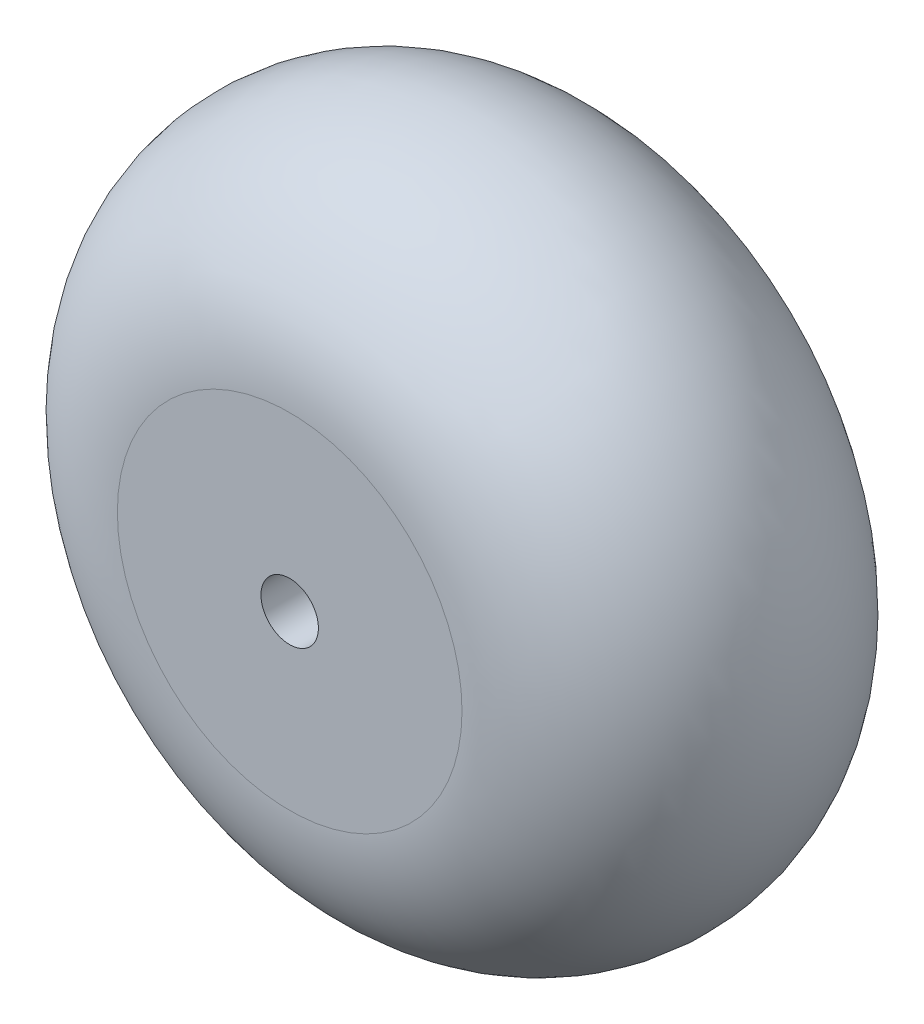
ISO-10303-21;
HEADER;
FILE_DESCRIPTION(('STEP AP214'),'2;1');
FILE_NAME('part.step','',(''),(''),'','','');
FILE_SCHEMA(('AUTOMOTIVE_DESIGN { 1 0 10303 214 1 1 1 1 }'));
ENDSEC;
DATA;
#1=APPLICATION_CONTEXT('core data for automotive mechanical design processes');
#2=APPLICATION_PROTOCOL_DEFINITION('international standard','automotive_design',2000,#1);
#3=PRODUCT_CONTEXT('',#1,'mechanical');
#4=PRODUCT('Part','Part','',(#3));
#5=PRODUCT_RELATED_PRODUCT_CATEGORY('part','',(#4));
#6=PRODUCT_DEFINITION_FORMATION('','',#4);
#7=PRODUCT_DEFINITION_CONTEXT('part definition',#1,'design');
#8=PRODUCT_DEFINITION('design','',#6,#7);
#9=PRODUCT_DEFINITION_SHAPE('','',#8);
#10=(LENGTH_UNIT() NAMED_UNIT(*) SI_UNIT(.MILLI.,.METRE.));
#11=(NAMED_UNIT(*) PLANE_ANGLE_UNIT() SI_UNIT($,.RADIAN.));
#12=(NAMED_UNIT(*) SI_UNIT($,.STERADIAN.) SOLID_ANGLE_UNIT());
#13=UNCERTAINTY_MEASURE_WITH_UNIT(LENGTH_MEASURE(1.E-05),#10,'distance_accuracy_value','');
#14=(GEOMETRIC_REPRESENTATION_CONTEXT(3) GLOBAL_UNCERTAINTY_ASSIGNED_CONTEXT((#13)) GLOBAL_UNIT_ASSIGNED_CONTEXT((#10,
#11,#12)) REPRESENTATION_CONTEXT('',''));
#15=CARTESIAN_POINT('',(0.,0.,0.));
#16=DIRECTION('',(0.,0.,1.));
#17=DIRECTION('',(1.,0.,0.));
#18=AXIS2_PLACEMENT_3D('',#15,#16,#17);
#19=CARTESIAN_POINT('',(0.,0.,15.));
#20=DIRECTION('',(0.,0.,1.));
#21=DIRECTION('',(1.,0.,0.));
#22=AXIS2_PLACEMENT_3D('',#19,#20,#21);
#23=DEGENERATE_TOROIDAL_SURFACE('',#22,15.,15.,.T.);
#24=CARTESIAN_POINT('',(0.,0.,0.));
#25=DIRECTION('',(0.,0.,1.));
#26=DIRECTION('',(1.,0.,0.));
#27=AXIS2_PLACEMENT_3D('',#24,#25,#26);
#28=CIRCLE('',#27,15.);
#29=CARTESIAN_POINT('',(15.,0.,0.));
#30=VERTEX_POINT('',#29);
#31=EDGE_CURVE('E40',#30,#30,#28,.F.);
#32=ORIENTED_EDGE('',*,*,#31,.F.);
#33=EDGE_LOOP('',(#32));
#34=FACE_BOUND('',#33,.T.);
#35=CARTESIAN_POINT('',(0.,0.,30.));
#36=DIRECTION('',(0.,0.,1.));
#37=DIRECTION('',(1.,0.,0.));
#38=AXIS2_PLACEMENT_3D('',#35,#36,#37);
#39=CIRCLE('',#38,15.);
#40=CARTESIAN_POINT('',(15.,0.,30.));
#41=VERTEX_POINT('',#40);
#42=EDGE_CURVE('E10',#41,#41,#39,.T.);
#43=ORIENTED_EDGE('',*,*,#42,.F.);
#44=EDGE_LOOP('',(#43));
#45=FACE_BOUND('',#44,.T.);
#46=ADVANCED_FACE('F33',(#34,#45),#23,.T.);
#47=CARTESIAN_POINT('',(0.,0.,30.));
#48=DIRECTION('',(0.,0.,1.));
#49=DIRECTION('',(1.,0.,0.));
#50=AXIS2_PLACEMENT_3D('',#47,#48,#49);
#51=PLANE('',#50);
#52=CARTESIAN_POINT('',(0.,0.,30.));
#53=DIRECTION('',(0.,0.,-1.));
#54=DIRECTION('',(-1.,0.,0.));
#55=AXIS2_PLACEMENT_3D('',#52,#53,#54);
#56=CIRCLE('',#55,2.5);
#57=CARTESIAN_POINT('',(-2.5,0.,30.));
#58=VERTEX_POINT('',#57);
#59=EDGE_CURVE('E44',#58,#58,#56,.T.);
#60=ORIENTED_EDGE('',*,*,#59,.T.);
#61=EDGE_LOOP('',(#60));
#62=FACE_BOUND('',#61,.T.);
#63=ORIENTED_EDGE('',*,*,#42,.T.);
#64=EDGE_LOOP('',(#63));
#65=FACE_BOUND('',#64,.T.);
#66=ADVANCED_FACE('F58',(#62,#65),#51,.T.);
#67=CARTESIAN_POINT('',(0.,0.,0.));
#68=DIRECTION('',(0.,0.,1.));
#69=DIRECTION('',(1.,0.,0.));
#70=AXIS2_PLACEMENT_3D('',#67,#68,#69);
#71=PLANE('',#70);
#72=CARTESIAN_POINT('',(0.,0.,0.));
#73=DIRECTION('',(0.,0.,-1.));
#74=DIRECTION('',(-1.,0.,0.));
#75=AXIS2_PLACEMENT_3D('',#72,#73,#74);
#76=CIRCLE('',#75,2.5);
#77=CARTESIAN_POINT('',(-2.5,0.,0.));
#78=VERTEX_POINT('',#77);
#79=EDGE_CURVE('E48',#78,#78,#76,.T.);
#80=ORIENTED_EDGE('',*,*,#79,.F.);
#81=EDGE_LOOP('',(#80));
#82=FACE_BOUND('',#81,.T.);
#83=ORIENTED_EDGE('',*,*,#31,.T.);
#84=EDGE_LOOP('',(#83));
#85=FACE_BOUND('',#84,.T.);
#86=ADVANCED_FACE('F56',(#82,#85),#71,.F.);
#87=CARTESIAN_POINT('',(0.,0.,30.));
#88=DIRECTION('',(0.,0.,-1.));
#89=DIRECTION('',(-1.,0.,0.));
#90=AXIS2_PLACEMENT_3D('',#87,#88,#89);
#91=CYLINDRICAL_SURFACE('',#90,2.5);
#92=ORIENTED_EDGE('',*,*,#59,.F.);
#93=EDGE_LOOP('',(#92));
#94=FACE_BOUND('',#93,.T.);
#95=ORIENTED_EDGE('',*,*,#79,.T.);
#96=EDGE_LOOP('',(#95));
#97=FACE_BOUND('',#96,.T.);
#98=ADVANCED_FACE('F54',(#94,#97),#91,.F.);
#99=CLOSED_SHELL('',(#46,#66,#86,#98));
#100=MANIFOLD_SOLID_BREP('B2',#99);
#101=ADVANCED_BREP_SHAPE_REPRESENTATION('',(#18,#100),#14);
#102=SHAPE_DEFINITION_REPRESENTATION(#9,#101);
ENDSEC;
END-ISO-10303-21;
